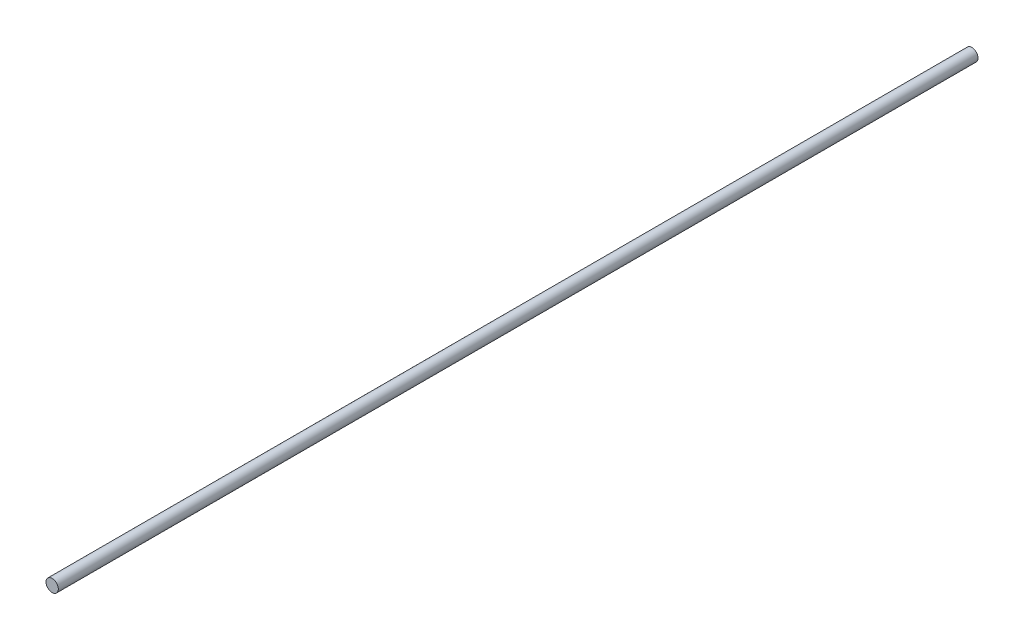
ISO-10303-21;
HEADER;
FILE_DESCRIPTION(('STEP AP214'),'2;1');
FILE_NAME('part.step','',(''),(''),'','','');
FILE_SCHEMA(('AUTOMOTIVE_DESIGN { 1 0 10303 214 1 1 1 1 }'));
ENDSEC;
DATA;
#1=APPLICATION_CONTEXT('core data for automotive mechanical design processes');
#2=APPLICATION_PROTOCOL_DEFINITION('international standard','automotive_design',2000,#1);
#3=PRODUCT_CONTEXT('',#1,'mechanical');
#4=PRODUCT('Part','Part','',(#3));
#5=PRODUCT_RELATED_PRODUCT_CATEGORY('part','',(#4));
#6=PRODUCT_DEFINITION_FORMATION('','',#4);
#7=PRODUCT_DEFINITION_CONTEXT('part definition',#1,'design');
#8=PRODUCT_DEFINITION('design','',#6,#7);
#9=PRODUCT_DEFINITION_SHAPE('','',#8);
#10=(LENGTH_UNIT() NAMED_UNIT(*) SI_UNIT(.MILLI.,.METRE.));
#11=(NAMED_UNIT(*) PLANE_ANGLE_UNIT() SI_UNIT($,.RADIAN.));
#12=(NAMED_UNIT(*) SI_UNIT($,.STERADIAN.) SOLID_ANGLE_UNIT());
#13=UNCERTAINTY_MEASURE_WITH_UNIT(LENGTH_MEASURE(1.E-05),#10,'distance_accuracy_value','');
#14=(GEOMETRIC_REPRESENTATION_CONTEXT(3) GLOBAL_UNCERTAINTY_ASSIGNED_CONTEXT((#13)) GLOBAL_UNIT_ASSIGNED_CONTEXT((#10,
#11,#12)) REPRESENTATION_CONTEXT('',''));
#15=CARTESIAN_POINT('',(0.,0.,0.));
#16=DIRECTION('',(0.,0.,1.));
#17=DIRECTION('',(1.,0.,0.));
#18=AXIS2_PLACEMENT_3D('',#15,#16,#17);
#19=CARTESIAN_POINT('',(0.,0.,825.5));
#20=DIRECTION('',(0.,0.,-1.));
#21=DIRECTION('',(-1.,0.,0.));
#22=AXIS2_PLACEMENT_3D('',#19,#20,#21);
#23=CYLINDRICAL_SURFACE('',#22,11.049);
#24=CARTESIAN_POINT('',(0.,0.,825.5));
#25=DIRECTION('',(0.,0.,1.));
#26=DIRECTION('',(1.,0.,0.));
#27=AXIS2_PLACEMENT_3D('',#24,#25,#26);
#28=CIRCLE('',#27,11.049);
#29=CARTESIAN_POINT('',(11.049,0.,825.5));
#30=VERTEX_POINT('',#29);
#31=EDGE_CURVE('E10',#30,#30,#28,.T.);
#32=ORIENTED_EDGE('',*,*,#31,.F.);
#33=EDGE_LOOP('',(#32));
#34=FACE_BOUND('',#33,.T.);
#35=CARTESIAN_POINT('',(0.,0.,-825.5));
#36=DIRECTION('',(0.,0.,1.));
#37=DIRECTION('',(1.,0.,0.));
#38=AXIS2_PLACEMENT_3D('',#35,#36,#37);
#39=CIRCLE('',#38,11.049);
#40=CARTESIAN_POINT('',(11.049,0.,-825.5));
#41=VERTEX_POINT('',#40);
#42=EDGE_CURVE('E37',#41,#41,#39,.T.);
#43=ORIENTED_EDGE('',*,*,#42,.T.);
#44=EDGE_LOOP('',(#43));
#45=FACE_BOUND('',#44,.T.);
#46=ADVANCED_FACE('F34',(#34,#45),#23,.T.);
#47=CARTESIAN_POINT('',(0.,0.,825.5));
#48=DIRECTION('',(0.,0.,1.));
#49=DIRECTION('',(1.,0.,0.));
#50=AXIS2_PLACEMENT_3D('',#47,#48,#49);
#51=PLANE('',#50);
#52=ORIENTED_EDGE('',*,*,#31,.T.);
#53=EDGE_LOOP('',(#52));
#54=FACE_BOUND('',#53,.T.);
#55=ADVANCED_FACE('F49',(#54),#51,.T.);
#56=CARTESIAN_POINT('',(0.,0.,-825.5));
#57=DIRECTION('',(0.,0.,1.));
#58=DIRECTION('',(1.,0.,0.));
#59=AXIS2_PLACEMENT_3D('',#56,#57,#58);
#60=PLANE('',#59);
#61=ORIENTED_EDGE('',*,*,#42,.F.);
#62=EDGE_LOOP('',(#61));
#63=FACE_BOUND('',#62,.T.);
#64=ADVANCED_FACE('F47',(#63),#60,.F.);
#65=CLOSED_SHELL('',(#46,#55,#64));
#66=MANIFOLD_SOLID_BREP('B2',#65);
#67=ADVANCED_BREP_SHAPE_REPRESENTATION('',(#18,#66),#14);
#68=SHAPE_DEFINITION_REPRESENTATION(#9,#67);
ENDSEC;
END-ISO-10303-21;
